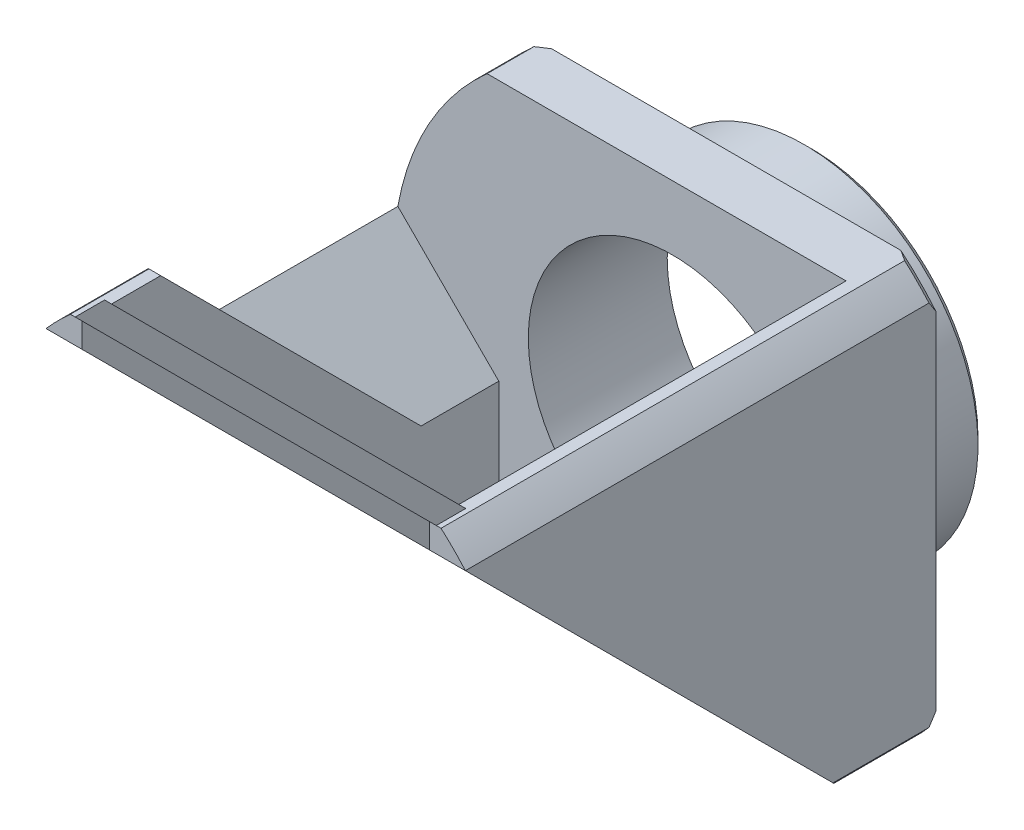
ISO-10303-21;
HEADER;
FILE_DESCRIPTION(('STEP AP214'),'2;1');
FILE_NAME('part.step','',(''),(''),'','','');
FILE_SCHEMA(('AUTOMOTIVE_DESIGN { 1 0 10303 214 1 1 1 1 }'));
ENDSEC;
DATA;
#1=APPLICATION_CONTEXT('core data for automotive mechanical design processes');
#2=APPLICATION_PROTOCOL_DEFINITION('international standard','automotive_design',2000,#1);
#3=PRODUCT_CONTEXT('',#1,'mechanical');
#4=PRODUCT('Part','Part','',(#3));
#5=PRODUCT_RELATED_PRODUCT_CATEGORY('part','',(#4));
#6=PRODUCT_DEFINITION_FORMATION('','',#4);
#7=PRODUCT_DEFINITION_CONTEXT('part definition',#1,'design');
#8=PRODUCT_DEFINITION('design','',#6,#7);
#9=PRODUCT_DEFINITION_SHAPE('','',#8);
#10=(LENGTH_UNIT() NAMED_UNIT(*) SI_UNIT(.MILLI.,.METRE.));
#11=(NAMED_UNIT(*) PLANE_ANGLE_UNIT() SI_UNIT($,.RADIAN.));
#12=(NAMED_UNIT(*) SI_UNIT($,.STERADIAN.) SOLID_ANGLE_UNIT());
#13=UNCERTAINTY_MEASURE_WITH_UNIT(LENGTH_MEASURE(1.E-05),#10,'distance_accuracy_value','');
#14=(GEOMETRIC_REPRESENTATION_CONTEXT(3) GLOBAL_UNCERTAINTY_ASSIGNED_CONTEXT((#13)) GLOBAL_UNIT_ASSIGNED_CONTEXT((#10,
#11,#12)) REPRESENTATION_CONTEXT('',''));
#15=CARTESIAN_POINT('',(0.,0.,0.));
#16=DIRECTION('',(0.,0.,1.));
#17=DIRECTION('',(1.,0.,0.));
#18=AXIS2_PLACEMENT_3D('',#15,#16,#17);
#19=CARTESIAN_POINT('',(0.,-15.24,-25.7974855953163));
#20=DIRECTION('',(0.,-1.,0.));
#21=DIRECTION('',(1.,0.,0.));
#22=AXIS2_PLACEMENT_3D('',#19,#20,#21);
#23=PLANE('',#22);
#24=DIRECTION('',(-1.,0.,0.));
#25=VECTOR('',#24,1.);
#26=CARTESIAN_POINT('',(14.8645111728715,-15.24,6.223));
#27=LINE('',#26,#25);
#28=CARTESIAN_POINT('',(27.6427308939441,-15.24,6.223));
#29=VERTEX_POINT('',#28);
#30=CARTESIAN_POINT('',(2.08629145179882,-15.24,6.223));
#31=VERTEX_POINT('',#30);
#32=EDGE_CURVE('E502',#29,#31,#27,.T.);
#33=ORIENTED_EDGE('',*,*,#32,.F.);
#34=CARTESIAN_POINT('',(27.6427308939441,-15.24,6.223));
#35=CARTESIAN_POINT('',(27.7729071237193,-15.24,6.30666414870029));
#36=CARTESIAN_POINT('',(27.9027556795337,-15.24,6.3908295644751));
#37=CARTESIAN_POINT('',(28.1617973943087,-15.24,6.56016289818711));
#38=CARTESIAN_POINT('',(28.2909905535169,-15.24,6.64533081574555));
#39=CARTESIAN_POINT('',(28.4198560390119,-15.24,6.73099999999977));
#40=B_SPLINE_CURVE_WITH_KNOTS('',3,(#34,#35,#36,#37,#38,#39),.UNSPECIFIED.,.F.,.F.,(4,2,4),(0.,
0.464219971497142,0.928439767614068),.UNSPECIFIED.);
#41=CARTESIAN_POINT('',(28.4198560390119,-15.24,6.73099999999976));
#42=VERTEX_POINT('',#41);
#43=EDGE_CURVE('E660',#29,#42,#40,.T.);
#44=ORIENTED_EDGE('',*,*,#43,.T.);
#45=DIRECTION('',(0.,0.,-1.));
#46=VECTOR('',#45,1.);
#47=CARTESIAN_POINT('',(28.4198560390119,-15.24,35.56));
#48=LINE('',#47,#46);
#49=CARTESIAN_POINT('',(28.4198560390119,-15.24,11.9560512242138));
#50=VERTEX_POINT('',#49);
#51=EDGE_CURVE('E380',#50,#42,#48,.T.);
#52=ORIENTED_EDGE('',*,*,#51,.F.);
#53=DIRECTION('',(1.,0.,0.));
#54=VECTOR('',#53,1.);
#55=CARTESIAN_POINT('',(0.,-15.24,11.9560512242138));
#56=LINE('',#55,#54);
#57=CARTESIAN_POINT('',(27.5645111728715,-15.24,11.9560512242138));
#58=VERTEX_POINT('',#57);
#59=EDGE_CURVE('E1137',#50,#58,#56,.F.);
#60=ORIENTED_EDGE('',*,*,#59,.T.);
#61=DIRECTION('',(0.,0.,1.));
#62=VECTOR('',#61,1.);
#63=CARTESIAN_POINT('',(27.5645111728715,-15.24,10.16));
#64=LINE('',#63,#62);
#65=CARTESIAN_POINT('',(27.5645111728715,-15.24,10.16));
#66=VERTEX_POINT('',#65);
#67=EDGE_CURVE('E303',#66,#58,#64,.T.);
#68=ORIENTED_EDGE('',*,*,#67,.F.);
#69=DIRECTION('',(-1.,0.,0.));
#70=VECTOR('',#69,1.);
#71=CARTESIAN_POINT('',(27.5645111728715,-15.24,10.16));
#72=LINE('',#71,#70);
#73=CARTESIAN_POINT('',(2.16451117287146,-15.24,10.16));
#74=VERTEX_POINT('',#73);
#75=EDGE_CURVE('E355',#66,#74,#72,.T.);
#76=ORIENTED_EDGE('',*,*,#75,.T.);
#77=DIRECTION('',(0.,0.,1.));
#78=VECTOR('',#77,1.);
#79=CARTESIAN_POINT('',(2.16451117287146,-15.24,10.16));
#80=LINE('',#79,#78);
#81=CARTESIAN_POINT('',(2.16451117287146,-15.24,11.9560512242138));
#82=VERTEX_POINT('',#81);
#83=EDGE_CURVE('E345',#74,#82,#80,.T.);
#84=ORIENTED_EDGE('',*,*,#83,.T.);
#85=DIRECTION('',(1.,0.,0.));
#86=VECTOR('',#85,1.);
#87=CARTESIAN_POINT('',(-5.53168882712855,-15.24,11.9560512242138));
#88=LINE('',#87,#86);
#89=CARTESIAN_POINT('',(1.30916630673102,-15.24,11.9560512242138));
#90=VERTEX_POINT('',#89);
#91=EDGE_CURVE('E492',#90,#82,#88,.T.);
#92=ORIENTED_EDGE('',*,*,#91,.F.);
#93=DIRECTION('',(0.,0.,1.));
#94=VECTOR('',#93,1.);
#95=CARTESIAN_POINT('',(1.30916630673101,-15.24,-25.7974855953163));
#96=LINE('',#95,#94);
#97=CARTESIAN_POINT('',(1.30916630673101,-15.24,6.73099999999976));
#98=VERTEX_POINT('',#97);
#99=EDGE_CURVE('E539',#90,#98,#96,.F.);
#100=ORIENTED_EDGE('',*,*,#99,.T.);
#101=CARTESIAN_POINT('',(1.30916630673102,-15.24,6.73099999999976));
#102=CARTESIAN_POINT('',(1.43803179222603,-15.24,6.64533081574554));
#103=CARTESIAN_POINT('',(1.56722495143419,-15.24,6.56016289818711));
#104=CARTESIAN_POINT('',(1.8262666662092,-15.24,6.3908295644751));
#105=CARTESIAN_POINT('',(1.95611522202365,-15.24,6.30666414870029));
#106=CARTESIAN_POINT('',(2.08629145179882,-15.24,6.223));
#107=B_SPLINE_CURVE_WITH_KNOTS('',3,(#101,#102,#103,#104,#105,#106),.UNSPECIFIED.,.F.,.F.,(4,2,
4),(0.,0.464219796116912,0.92843976761404),.UNSPECIFIED.);
#108=EDGE_CURVE('E653',#98,#31,#107,.T.);
#109=ORIENTED_EDGE('',*,*,#108,.T.);
#110=EDGE_LOOP('',(#33,#44,#52,#60,#68,#76,#84,#92,#100,#109));
#111=FACE_BOUND('',#110,.T.);
#112=ADVANCED_FACE('F56',(#111),#23,.T.);
#113=CARTESIAN_POINT('',(0.,15.24,-25.7974855953163));
#114=DIRECTION('',(0.,-1.,0.));
#115=DIRECTION('',(0.,0.,-1.));
#116=AXIS2_PLACEMENT_3D('',#113,#114,#115);
#117=PLANE('',#116);
#118=DIRECTION('',(0.,0.,-1.));
#119=VECTOR('',#118,1.);
#120=CARTESIAN_POINT('',(28.4198560390087,15.2400000000029,35.56));
#121=LINE('',#120,#119);
#122=CARTESIAN_POINT('',(28.4198560390087,15.2400000000029,6.73099999999976));
#123=VERTEX_POINT('',#122);
#124=CARTESIAN_POINT('',(28.4198560390103,15.2400000000014,40.64));
#125=VERTEX_POINT('',#124);
#126=EDGE_CURVE('E387',#123,#125,#121,.F.);
#127=ORIENTED_EDGE('',*,*,#126,.F.);
#128=CARTESIAN_POINT('',(28.4198560390087,15.2400000000029,6.73099999999976));
#129=CARTESIAN_POINT('',(28.2909905535145,15.2400000000014,6.64533081574505));
#130=CARTESIAN_POINT('',(28.1617973943071,15.2400000000005,6.56016289818637));
#131=CARTESIAN_POINT('',(27.9027556795331,15.2399999999995,6.39082956447436));
#132=CARTESIAN_POINT('',(27.7729071237191,15.2399999999995,6.30666414869979));
#133=CARTESIAN_POINT('',(27.6427308939441,15.24,6.223));
#134=B_SPLINE_CURVE_WITH_KNOTS('',3,(#128,#129,#130,#131,#132,#133),.UNSPECIFIED.,.F.,.F.,(4,2,
4),(0.,0.464219796115568,0.92843976761134),.UNSPECIFIED.);
#135=CARTESIAN_POINT('',(27.6427308939441,15.24,6.223));
#136=VERTEX_POINT('',#135);
#137=EDGE_CURVE('E81',#123,#136,#134,.T.);
#138=ORIENTED_EDGE('',*,*,#137,.T.);
#139=DIRECTION('',(-1.,0.,0.));
#140=VECTOR('',#139,1.);
#141=CARTESIAN_POINT('',(14.8645111728715,15.24,6.223));
#142=LINE('',#141,#140);
#143=CARTESIAN_POINT('',(2.08629145179882,15.24,6.223));
#144=VERTEX_POINT('',#143);
#145=EDGE_CURVE('E389',#144,#136,#142,.F.);
#146=ORIENTED_EDGE('',*,*,#145,.F.);
#147=CARTESIAN_POINT('',(2.08629145179882,15.24,6.223));
#148=CARTESIAN_POINT('',(1.95611522202365,15.24,6.30666414870029));
#149=CARTESIAN_POINT('',(1.82626666620921,15.24,6.3908295644751));
#150=CARTESIAN_POINT('',(1.56722495143419,15.24,6.56016289818711));
#151=CARTESIAN_POINT('',(1.43803179222603,15.24,6.64533081574555));
#152=CARTESIAN_POINT('',(1.30916630673102,15.24,6.73099999999976));
#153=B_SPLINE_CURVE_WITH_KNOTS('',3,(#147,#148,#149,#150,#151,#152),.UNSPECIFIED.,.F.,.F.,(4,2,
4),(0.,0.464219971497129,0.928439767614042),.UNSPECIFIED.);
#154=CARTESIAN_POINT('',(1.30916630673101,15.24,6.73099999999976));
#155=VERTEX_POINT('',#154);
#156=EDGE_CURVE('E73',#144,#155,#153,.T.);
#157=ORIENTED_EDGE('',*,*,#156,.T.);
#158=DIRECTION('',(0.,0.,-1.));
#159=VECTOR('',#158,1.);
#160=CARTESIAN_POINT('',(1.30916630673101,15.24,-25.7974855953163));
#161=LINE('',#160,#159);
#162=CARTESIAN_POINT('',(1.30916630673102,15.24,10.16));
#163=VERTEX_POINT('',#162);
#164=EDGE_CURVE('E320',#163,#155,#161,.T.);
#165=ORIENTED_EDGE('',*,*,#164,.F.);
#166=DIRECTION('',(-1.,0.,0.));
#167=VECTOR('',#166,1.);
#168=CARTESIAN_POINT('',(2.16451117287145,15.24,10.16));
#169=LINE('',#168,#167);
#170=CARTESIAN_POINT('',(27.5645111728715,15.24,10.16));
#171=VERTEX_POINT('',#170);
#172=EDGE_CURVE('E1289',#171,#163,#169,.T.);
#173=ORIENTED_EDGE('',*,*,#172,.F.);
#174=DIRECTION('',(0.,0.,-1.));
#175=VECTOR('',#174,1.);
#176=CARTESIAN_POINT('',(27.5645111728715,15.24,40.64));
#177=LINE('',#176,#175);
#178=CARTESIAN_POINT('',(27.5645111728715,15.24,38.4847385309434));
#179=VERTEX_POINT('',#178);
#180=EDGE_CURVE('E297',#179,#171,#177,.T.);
#181=ORIENTED_EDGE('',*,*,#180,.F.);
#182=DIRECTION('',(-1.,0.,0.));
#183=VECTOR('',#182,1.);
#184=CARTESIAN_POINT('',(28.0725111728715,15.24,38.4847385309434));
#185=LINE('',#184,#183);
#186=CARTESIAN_POINT('',(28.0725111728715,15.24,38.4847385309434));
#187=VERTEX_POINT('',#186);
#188=EDGE_CURVE('E262',#187,#179,#185,.T.);
#189=ORIENTED_EDGE('',*,*,#188,.F.);
#190=DIRECTION('',(0.,0.,-1.));
#191=VECTOR('',#190,1.);
#192=CARTESIAN_POINT('',(28.0725111728715,15.24,40.64));
#193=LINE('',#192,#191);
#194=CARTESIAN_POINT('',(28.0725111728715,15.24,40.64));
#195=VERTEX_POINT('',#194);
#196=EDGE_CURVE('E236',#195,#187,#193,.T.);
#197=ORIENTED_EDGE('',*,*,#196,.F.);
#198=DIRECTION('',(1.,0.,0.));
#199=VECTOR('',#198,1.);
#200=CARTESIAN_POINT('',(0.,15.24,40.64));
#201=LINE('',#200,#199);
#202=EDGE_CURVE('E326',#125,#195,#201,.F.);
#203=ORIENTED_EDGE('',*,*,#202,.F.);
#204=EDGE_LOOP('',(#127,#138,#146,#157,#165,#173,#181,#189,#197,#203));
#205=FACE_BOUND('',#204,.T.);
#206=ADVANCED_FACE('F644',(#205),#117,.F.);
#207=CARTESIAN_POINT('',(0.,0.,40.64));
#208=DIRECTION('',(0.,0.,1.));
#209=DIRECTION('',(1.,0.,0.));
#210=AXIS2_PLACEMENT_3D('',#207,#208,#209);
#211=PLANE('',#210);
#212=ORIENTED_EDGE('',*,*,#202,.T.);
#213=DIRECTION('',(-1.,0.,0.));
#214=VECTOR('',#213,1.);
#215=CARTESIAN_POINT('',(28.0725111728715,15.24,40.64));
#216=LINE('',#215,#214);
#217=CARTESIAN_POINT('',(27.5645111728715,15.24,40.64));
#218=VERTEX_POINT('',#217);
#219=EDGE_CURVE('E265',#195,#218,#216,.T.);
#220=ORIENTED_EDGE('',*,*,#219,.T.);
#221=DIRECTION('',(0.,1.,0.));
#222=VECTOR('',#221,1.);
#223=CARTESIAN_POINT('',(27.5645111728715,13.4439487757862,40.64));
#224=LINE('',#223,#222);
#225=CARTESIAN_POINT('',(27.5645111728715,13.4439487757862,40.64));
#226=VERTEX_POINT('',#225);
#227=EDGE_CURVE('E300',#226,#218,#224,.T.);
#228=ORIENTED_EDGE('',*,*,#227,.F.);
#229=DIRECTION('',(1.,0.,0.));
#230=VECTOR('',#229,1.);
#231=CARTESIAN_POINT('',(35.260711172874,13.4439487757862,40.64));
#232=LINE('',#231,#230);
#233=CARTESIAN_POINT('',(30.2028688344348,13.4439487757862,40.64));
#234=VERTEX_POINT('',#233);
#235=EDGE_CURVE('E369',#226,#234,#232,.T.);
#236=ORIENTED_EDGE('',*,*,#235,.T.);
#237=CARTESIAN_POINT('',(14.8645111728715,0.,40.64));
#238=DIRECTION('',(0.,0.,-1.));
#239=DIRECTION('',(-1.,0.,0.));
#240=AXIS2_PLACEMENT_3D('',#237,#238,#239);
#241=CIRCLE('',#240,20.3962);
#242=EDGE_CURVE('E406',#125,#234,#241,.T.);
#243=ORIENTED_EDGE('',*,*,#242,.F.);
#244=EDGE_LOOP('',(#212,#220,#228,#236,#243));
#245=FACE_BOUND('',#244,.T.);
#246=ADVANCED_FACE('F367',(#245),#211,.T.);
#247=CARTESIAN_POINT('',(35.260711172874,13.4439487757862,40.64));
#248=DIRECTION('',(0.,0.707106781186548,-0.707106781186548));
#249=DIRECTION('',(0.,0.707106781186548,0.707106781186548));
#250=AXIS2_PLACEMENT_3D('',#247,#248,#249);
#251=PLANE('',#250);
#252=DIRECTION('',(0.,0.707106781186547,0.707106781186548));
#253=VECTOR('',#252,1.);
#254=CARTESIAN_POINT('',(27.5645111728715,-15.24,11.9560512242138));
#255=LINE('',#254,#253);
#256=EDGE_CURVE('E348',#58,#226,#255,.T.);
#257=ORIENTED_EDGE('',*,*,#256,.F.);
#258=ORIENTED_EDGE('',*,*,#59,.F.);
#259=CARTESIAN_POINT('',(14.8645111728715,0.,27.1960512242138));
#260=DIRECTION('',(0.,0.707106781186548,-0.707106781186548));
#261=DIRECTION('',(0.,-0.707106781186548,-0.707106781186548));
#262=AXIS2_PLACEMENT_3D('',#259,#260,#261);
#263=ELLIPSE('',#262,28.8445826608741,20.3962);
#264=CARTESIAN_POINT('',(30.2028688344348,-13.4439487757862,13.7521024484277));
#265=VERTEX_POINT('',#264);
#266=EDGE_CURVE('E379',#265,#50,#263,.T.);
#267=ORIENTED_EDGE('',*,*,#266,.F.);
#268=DIRECTION('',(0.,0.707106781186548,0.707106781186548));
#269=VECTOR('',#268,1.);
#270=CARTESIAN_POINT('',(30.2028688344348,-13.4439487757862,13.7521024484277));
#271=LINE('',#270,#269);
#272=EDGE_CURVE('E377',#265,#234,#271,.T.);
#273=ORIENTED_EDGE('',*,*,#272,.T.);
#274=ORIENTED_EDGE('',*,*,#235,.F.);
#275=EDGE_LOOP('',(#257,#258,#267,#273,#274));
#276=FACE_BOUND('',#275,.T.);
#277=ADVANCED_FACE('F373',(#276),#251,.F.);
#278=CARTESIAN_POINT('',(-5.45548882712859,3.81,23.4626360825158));
#279=DIRECTION('',(0.707106781186551,0.707106781186544,0.));
#280=DIRECTION('',(-0.707106781186544,0.707106781186551,0.));
#281=AXIS2_PLACEMENT_3D('',#278,#279,#280);
#282=PLANE('',#281);
#283=DIRECTION('',(0.577350269189622,-0.577350269189628,-0.577350269189628));
#284=VECTOR('',#283,1.);
#285=CARTESIAN_POINT('',(-5.21662353885917,3.57113471173058,23.2237707942464));
#286=LINE('',#285,#284);
#287=CARTESIAN_POINT('',(-5.21662353885917,3.57113471173058,23.2237707942464));
#288=VERTEX_POINT('',#287);
#289=CARTESIAN_POINT('',(2.16451117287146,-3.81000000000013,15.8426360825157));
#290=VERTEX_POINT('',#289);
#291=EDGE_CURVE('E479',#288,#290,#286,.T.);
#292=ORIENTED_EDGE('',*,*,#291,.T.);
#293=DIRECTION('',(0.,0.,1.));
#294=VECTOR('',#293,1.);
#295=CARTESIAN_POINT('',(2.16451117287146,-3.81000000000014,10.16));
#296=LINE('',#295,#294);
#297=CARTESIAN_POINT('',(2.16451117287146,-3.81000000000013,10.16));
#298=VERTEX_POINT('',#297);
#299=EDGE_CURVE('E328',#298,#290,#296,.T.);
#300=ORIENTED_EDGE('',*,*,#299,.F.);
#301=DIRECTION('',(0.707106781186543,-0.707106781186552,0.));
#302=VECTOR('',#301,1.);
#303=CARTESIAN_POINT('',(-5.21662353885917,3.57113471173058,10.16));
#304=LINE('',#303,#302);
#305=CARTESIAN_POINT('',(-5.21662353885917,3.57113471173058,10.16));
#306=VERTEX_POINT('',#305);
#307=EDGE_CURVE('E1287',#306,#298,#304,.T.);
#308=ORIENTED_EDGE('',*,*,#307,.F.);
#309=DIRECTION('',(0.,0.,-1.));
#310=VECTOR('',#309,1.);
#311=CARTESIAN_POINT('',(-5.21662353885917,3.57113471173059,35.56));
#312=LINE('',#311,#310);
#313=EDGE_CURVE('E1121',#288,#306,#312,.T.);
#314=ORIENTED_EDGE('',*,*,#313,.F.);
#315=EDGE_LOOP('',(#292,#300,#308,#314));
#316=FACE_BOUND('',#315,.T.);
#317=ADVANCED_FACE('F591',(#316),#282,.T.);
#318=CARTESIAN_POINT('',(14.8645111728715,0.,35.56));
#319=DIRECTION('',(0.,0.,-1.));
#320=DIRECTION('',(-1.,0.,0.));
#321=AXIS2_PLACEMENT_3D('',#318,#319,#320);
#322=CYLINDRICAL_SURFACE('',#321,20.3962);
#323=ORIENTED_EDGE('',*,*,#164,.T.);
#324=CARTESIAN_POINT('',(14.8645111728715,0.,6.73099999999976));
#325=DIRECTION('',(0.,0.,-1.));
#326=DIRECTION('',(-1.,0.,0.));
#327=AXIS2_PLACEMENT_3D('',#324,#325,#326);
#328=CIRCLE('',#327,20.3962);
#329=EDGE_CURVE('E13',#155,#98,#328,.F.);
#330=ORIENTED_EDGE('',*,*,#329,.T.);
#331=ORIENTED_EDGE('',*,*,#99,.F.);
#332=CARTESIAN_POINT('',(14.8645111728715,0.,27.1960512242138));
#333=DIRECTION('',(0.,-0.707106781186548,0.707106781186548));
#334=DIRECTION('',(0.,-0.707106781186548,-0.707106781186548));
#335=AXIS2_PLACEMENT_3D('',#332,#333,#334);
#336=ELLIPSE('',#335,28.8445826608741,20.3962);
#337=CARTESIAN_POINT('',(-0.47384648869184,13.4439487757862,40.64));
#338=VERTEX_POINT('',#337);
#339=EDGE_CURVE('E558',#90,#338,#336,.F.);
#340=ORIENTED_EDGE('',*,*,#339,.T.);
#341=CARTESIAN_POINT('',(14.8645111728715,0.,40.64));
#342=DIRECTION('',(0.,0.,-1.));
#343=DIRECTION('',(-1.,0.,0.));
#344=AXIS2_PLACEMENT_3D('',#341,#342,#343);
#345=CIRCLE('',#344,20.3962);
#346=CARTESIAN_POINT('',(1.30916630673102,15.24,40.64));
#347=VERTEX_POINT('',#346);
#348=EDGE_CURVE('E551',#338,#347,#345,.T.);
#349=ORIENTED_EDGE('',*,*,#348,.T.);
#350=DIRECTION('',(0.,0.,-1.));
#351=VECTOR('',#350,1.);
#352=CARTESIAN_POINT('',(1.30916630673102,15.24,35.56));
#353=LINE('',#352,#351);
#354=CARTESIAN_POINT('',(1.30916630673102,15.24,34.8926360825158));
#355=VERTEX_POINT('',#354);
#356=EDGE_CURVE('E557',#347,#355,#353,.T.);
#357=ORIENTED_EDGE('',*,*,#356,.T.);
#358=CARTESIAN_POINT('',(14.8645111728715,0.,19.6526360825158));
#359=DIRECTION('',(0.,-0.707106781186548,0.707106781186547));
#360=DIRECTION('',(0.,-0.707106781186547,-0.707106781186548));
#361=AXIS2_PLACEMENT_3D('',#358,#359,#360);
#362=ELLIPSE('',#361,28.8445826608741,20.3962);
#363=EDGE_CURVE('E559',#355,#288,#362,.T.);
#364=ORIENTED_EDGE('',*,*,#363,.T.);
#365=ORIENTED_EDGE('',*,*,#313,.T.);
#366=CARTESIAN_POINT('',(14.8645111728715,0.,10.16));
#367=DIRECTION('',(0.,0.,1.));
#368=DIRECTION('',(1.,0.,0.));
#369=AXIS2_PLACEMENT_3D('',#366,#367,#368);
#370=CIRCLE('',#369,20.3962);
#371=EDGE_CURVE('E1284',#163,#306,#370,.T.);
#372=ORIENTED_EDGE('',*,*,#371,.F.);
#373=EDGE_LOOP('',(#323,#330,#331,#340,#349,#357,#364,#365,#372));
#374=FACE_BOUND('',#373,.T.);
#375=ADVANCED_FACE('F642',(#374),#322,.T.);
#376=DIRECTION('',(0.,0.,1.));
#377=VECTOR('',#376,1.);
#378=CARTESIAN_POINT('',(1.65651117287145,15.24,38.4847385309434));
#379=LINE('',#378,#377);
#380=CARTESIAN_POINT('',(1.65651117287145,15.24,38.4847385309434));
#381=VERTEX_POINT('',#380);
#382=CARTESIAN_POINT('',(1.65651117287145,15.24,40.64));
#383=VERTEX_POINT('',#382);
#384=EDGE_CURVE('E270',#381,#383,#379,.T.);
#385=ORIENTED_EDGE('',*,*,#384,.F.);
#386=DIRECTION('',(1.,0.,0.));
#387=VECTOR('',#386,1.);
#388=CARTESIAN_POINT('',(1.65651117287145,15.24,38.4847385309434));
#389=LINE('',#388,#387);
#390=CARTESIAN_POINT('',(2.16451117287146,15.24,38.4847385309434));
#391=VERTEX_POINT('',#390);
#392=EDGE_CURVE('E290',#381,#391,#389,.T.);
#393=ORIENTED_EDGE('',*,*,#392,.T.);
#394=DIRECTION('',(0.,0.,-1.));
#395=VECTOR('',#394,1.);
#396=CARTESIAN_POINT('',(2.16451117287146,15.24,40.64));
#397=LINE('',#396,#395);
#398=CARTESIAN_POINT('',(2.16451117287146,15.24,34.8926360825158));
#399=VERTEX_POINT('',#398);
#400=EDGE_CURVE('E309',#391,#399,#397,.T.);
#401=ORIENTED_EDGE('',*,*,#400,.T.);
#402=DIRECTION('',(1.,0.,0.));
#403=VECTOR('',#402,1.);
#404=CARTESIAN_POINT('',(-5.53268882712855,15.24,34.8926360825158));
#405=LINE('',#404,#403);
#406=EDGE_CURVE('E481',#399,#355,#405,.F.);
#407=ORIENTED_EDGE('',*,*,#406,.T.);
#408=ORIENTED_EDGE('',*,*,#356,.F.);
#409=EDGE_CURVE('E315',#383,#347,#201,.F.);
#410=ORIENTED_EDGE('',*,*,#409,.F.);
#411=EDGE_LOOP('',(#385,#393,#401,#407,#408,#410));
#412=FACE_BOUND('',#411,.T.);
#413=ADVANCED_FACE('F637',(#412),#117,.F.);
#414=DIRECTION('',(0.,1.,0.));
#415=VECTOR('',#414,1.);
#416=CARTESIAN_POINT('',(2.16451117287146,13.4439487757862,40.64));
#417=LINE('',#416,#415);
#418=CARTESIAN_POINT('',(2.16451117287146,13.4439487757862,40.64));
#419=VERTEX_POINT('',#418);
#420=CARTESIAN_POINT('',(2.16451117287146,15.24,40.64));
#421=VERTEX_POINT('',#420);
#422=EDGE_CURVE('E312',#419,#421,#417,.T.);
#423=ORIENTED_EDGE('',*,*,#422,.T.);
#424=EDGE_CURVE('E319',#421,#383,#201,.F.);
#425=ORIENTED_EDGE('',*,*,#424,.T.);
#426=ORIENTED_EDGE('',*,*,#409,.T.);
#427=ORIENTED_EDGE('',*,*,#348,.F.);
#428=DIRECTION('',(1.,0.,0.));
#429=VECTOR('',#428,1.);
#430=CARTESIAN_POINT('',(0.,13.4439487757862,40.64));
#431=LINE('',#430,#429);
#432=EDGE_CURVE('E486',#338,#419,#431,.T.);
#433=ORIENTED_EDGE('',*,*,#432,.T.);
#434=EDGE_LOOP('',(#423,#425,#426,#427,#433));
#435=FACE_BOUND('',#434,.T.);
#436=ADVANCED_FACE('F641',(#435),#211,.T.);
#437=CARTESIAN_POINT('',(14.8645111728715,0.,6.223));
#438=DIRECTION('',(0.,0.,-1.));
#439=DIRECTION('',(-1.,0.,0.));
#440=AXIS2_PLACEMENT_3D('',#437,#438,#439);
#441=PLANE('',#440);
#442=CARTESIAN_POINT('',(14.8645111728715,0.,6.223));
#443=DIRECTION('',(0.,0.,-1.));
#444=DIRECTION('',(-1.,0.,0.));
#445=AXIS2_PLACEMENT_3D('',#442,#443,#444);
#446=CIRCLE('',#445,12.7);
#447=CARTESIAN_POINT('',(2.16451117287146,0.,6.223));
#448=VERTEX_POINT('',#447);
#449=EDGE_CURVE('E254',#448,#448,#446,.T.);
#450=ORIENTED_EDGE('',*,*,#449,.F.);
#451=EDGE_LOOP('',(#450));
#452=FACE_BOUND('',#451,.T.);
#453=DIRECTION('',(0.,1.,0.));
#454=VECTOR('',#453,1.);
#455=CARTESIAN_POINT('',(30.2028688344348,13.4439487757862,6.223));
#456=LINE('',#455,#454);
#457=CARTESIAN_POINT('',(30.2028688344348,12.6599874994398,6.223));
#458=VERTEX_POINT('',#457);
#459=CARTESIAN_POINT('',(30.2028688344348,-12.6599874994398,6.223));
#460=VERTEX_POINT('',#459);
#461=EDGE_CURVE('E410',#458,#460,#456,.F.);
#462=ORIENTED_EDGE('',*,*,#461,.T.);
#463=CARTESIAN_POINT('',(14.8645111728715,0.,6.223));
#464=DIRECTION('',(0.,0.,-1.));
#465=DIRECTION('',(-1.,0.,0.));
#466=AXIS2_PLACEMENT_3D('',#463,#464,#465);
#467=CIRCLE('',#466,19.8882000000002);
#468=EDGE_CURVE('E1255',#460,#29,#467,.T.);
#469=ORIENTED_EDGE('',*,*,#468,.T.);
#470=ORIENTED_EDGE('',*,*,#32,.T.);
#471=CARTESIAN_POINT('',(14.8645111728715,0.,6.223));
#472=DIRECTION('',(0.,0.,-1.));
#473=DIRECTION('',(-1.,0.,0.));
#474=AXIS2_PLACEMENT_3D('',#471,#472,#473);
#475=CIRCLE('',#474,19.8882000000002);
#476=EDGE_CURVE('E1256',#31,#144,#475,.T.);
#477=ORIENTED_EDGE('',*,*,#476,.T.);
#478=ORIENTED_EDGE('',*,*,#145,.T.);
#479=CARTESIAN_POINT('',(14.8645111728715,0.,6.223));
#480=DIRECTION('',(0.,0.,-1.));
#481=DIRECTION('',(-1.,0.,0.));
#482=AXIS2_PLACEMENT_3D('',#479,#480,#481);
#483=CIRCLE('',#482,19.8882000000002);
#484=EDGE_CURVE('E1253',#136,#458,#483,.T.);
#485=ORIENTED_EDGE('',*,*,#484,.T.);
#486=EDGE_LOOP('',(#462,#469,#470,#477,#478,#485));
#487=FACE_BOUND('',#486,.T.);
#488=ADVANCED_FACE('F749',(#452,#487),#441,.T.);
#489=CARTESIAN_POINT('',(14.8645111728715,0.,35.56));
#490=DIRECTION('',(0.,0.,-1.));
#491=DIRECTION('',(-1.,0.,0.));
#492=AXIS2_PLACEMENT_3D('',#489,#490,#491);
#493=CYLINDRICAL_SURFACE('',#492,20.3962);
#494=ORIENTED_EDGE('',*,*,#51,.T.);
#495=CARTESIAN_POINT('',(14.8645111728715,0.,6.73099999999976));
#496=DIRECTION('',(0.,0.,-1.));
#497=DIRECTION('',(-1.,0.,0.));
#498=AXIS2_PLACEMENT_3D('',#495,#496,#497);
#499=CIRCLE('',#498,20.3962);
#500=CARTESIAN_POINT('',(30.2028688344348,-13.4439487757862,6.73099999999976));
#501=VERTEX_POINT('',#500);
#502=EDGE_CURVE('E321',#42,#501,#499,.F.);
#503=ORIENTED_EDGE('',*,*,#502,.T.);
#504=DIRECTION('',(0.,0.,1.));
#505=VECTOR('',#504,1.);
#506=CARTESIAN_POINT('',(30.2028688344348,-13.4439487757862,-0.001000000000001));
#507=LINE('',#506,#505);
#508=EDGE_CURVE('E568',#501,#265,#507,.T.);
#509=ORIENTED_EDGE('',*,*,#508,.T.);
#510=ORIENTED_EDGE('',*,*,#266,.T.);
#511=EDGE_LOOP('',(#494,#503,#509,#510));
#512=FACE_BOUND('',#511,.T.);
#513=ADVANCED_FACE('F753',(#512),#493,.T.);
#514=ORIENTED_EDGE('',*,*,#91,.T.);
#515=DIRECTION('',(0.,0.707106781186547,0.707106781186548));
#516=VECTOR('',#515,1.);
#517=CARTESIAN_POINT('',(2.16451117287146,-15.24,11.9560512242138));
#518=LINE('',#517,#516);
#519=EDGE_CURVE('E293',#82,#419,#518,.T.);
#520=ORIENTED_EDGE('',*,*,#519,.T.);
#521=ORIENTED_EDGE('',*,*,#432,.F.);
#522=ORIENTED_EDGE('',*,*,#339,.F.);
#523=EDGE_LOOP('',(#514,#520,#521,#522));
#524=FACE_BOUND('',#523,.T.);
#525=ADVANCED_FACE('F761',(#524),#251,.F.);
#526=CARTESIAN_POINT('',(14.8645111728715,0.,35.56));
#527=DIRECTION('',(0.,0.,-1.));
#528=DIRECTION('',(-1.,0.,0.));
#529=AXIS2_PLACEMENT_3D('',#526,#527,#528);
#530=CYLINDRICAL_SURFACE('',#529,20.3962);
#531=DIRECTION('',(0.,0.,1.));
#532=VECTOR('',#531,1.);
#533=CARTESIAN_POINT('',(30.2028688344348,13.4439487757862,-0.001000000000001));
#534=LINE('',#533,#532);
#535=CARTESIAN_POINT('',(30.2028688344348,13.4439487757862,6.73099999999976));
#536=VERTEX_POINT('',#535);
#537=EDGE_CURVE('E565',#234,#536,#534,.F.);
#538=ORIENTED_EDGE('',*,*,#537,.T.);
#539=CARTESIAN_POINT('',(14.8645111728715,0.,6.73099999999976));
#540=DIRECTION('',(0.,0.,-1.));
#541=DIRECTION('',(-1.,0.,0.));
#542=AXIS2_PLACEMENT_3D('',#539,#540,#541);
#543=CIRCLE('',#542,20.3962);
#544=EDGE_CURVE('E665',#536,#123,#543,.F.);
#545=ORIENTED_EDGE('',*,*,#544,.T.);
#546=ORIENTED_EDGE('',*,*,#126,.T.);
#547=ORIENTED_EDGE('',*,*,#242,.T.);
#548=EDGE_LOOP('',(#538,#545,#546,#547));
#549=FACE_BOUND('',#548,.T.);
#550=ADVANCED_FACE('F589',(#549),#530,.T.);
#551=CARTESIAN_POINT('',(30.2028688344348,13.4439487757862,-0.001000000000001));
#552=DIRECTION('',(-1.,0.,0.));
#553=DIRECTION('',(0.,0.,1.));
#554=AXIS2_PLACEMENT_3D('',#551,#552,#553);
#555=PLANE('',#554);
#556=ORIENTED_EDGE('',*,*,#508,.F.);
#557=CARTESIAN_POINT('',(30.2028688344348,-13.4439487757862,6.73099999999976));
#558=CARTESIAN_POINT('',(30.2028688344348,-13.3139617670491,6.64529448123285));
#559=CARTESIAN_POINT('',(30.2028688344348,-13.1836381694069,6.5601083968503));
#560=CARTESIAN_POINT('',(30.2028688344348,-12.9223177442265,6.39077506310292));
#561=CARTESIAN_POINT('',(30.2028688344348,-12.7913209164199,6.30662781415221));
#562=CARTESIAN_POINT('',(30.2028688344348,-12.6599874994398,6.223));
#563=B_SPLINE_CURVE_WITH_KNOTS('',3,(#557,#558,#559,#560,#561,#562),.UNSPECIFIED.,.F.,.F.,(4,2,
4),(0.,0.467084769258856,0.934169724713637),.UNSPECIFIED.);
#564=EDGE_CURVE('E603',#501,#460,#563,.T.);
#565=ORIENTED_EDGE('',*,*,#564,.T.);
#566=ORIENTED_EDGE('',*,*,#461,.F.);
#567=CARTESIAN_POINT('',(30.2028688344348,12.6599874994398,6.223));
#568=CARTESIAN_POINT('',(30.2028688344348,12.7913209164199,6.30662781415222));
#569=CARTESIAN_POINT('',(30.2028688344348,12.9223177442265,6.39077506310292));
#570=CARTESIAN_POINT('',(30.2028688344348,13.1836381694069,6.5601083968503));
#571=CARTESIAN_POINT('',(30.2028688344348,13.3139617670491,6.64529448123285));
#572=CARTESIAN_POINT('',(30.2028688344348,13.4439487757862,6.73099999999976));
#573=B_SPLINE_CURVE_WITH_KNOTS('',3,(#567,#568,#569,#570,#571,#572),.UNSPECIFIED.,.F.,.F.,(4,2,
4),(0.,0.467084955454769,0.934169724713614),.UNSPECIFIED.);
#574=EDGE_CURVE('E597',#458,#536,#573,.T.);
#575=ORIENTED_EDGE('',*,*,#574,.T.);
#576=ORIENTED_EDGE('',*,*,#537,.F.);
#577=ORIENTED_EDGE('',*,*,#272,.F.);
#578=EDGE_LOOP('',(#556,#565,#566,#575,#576,#577));
#579=FACE_BOUND('',#578,.T.);
#580=ADVANCED_FACE('F583',(#579),#555,.F.);
#581=CARTESIAN_POINT('',(-5.53268882712855,15.24,34.8926360825158));
#582=DIRECTION('',(0.,-0.707106781186548,0.707106781186547));
#583=DIRECTION('',(0.,-0.707106781186547,-0.707106781186548));
#584=AXIS2_PLACEMENT_3D('',#581,#582,#583);
#585=PLANE('',#584);
#586=DIRECTION('',(0.,0.707106781186547,0.707106781186548));
#587=VECTOR('',#586,1.);
#588=CARTESIAN_POINT('',(2.16451117287146,-3.81000000000013,15.8426360825157));
#589=LINE('',#588,#587);
#590=EDGE_CURVE('E564',#290,#399,#589,.T.);
#591=ORIENTED_EDGE('',*,*,#590,.F.);
#592=ORIENTED_EDGE('',*,*,#291,.F.);
#593=ORIENTED_EDGE('',*,*,#363,.F.);
#594=ORIENTED_EDGE('',*,*,#406,.F.);
#595=EDGE_LOOP('',(#591,#592,#593,#594));
#596=FACE_BOUND('',#595,.T.);
#597=ADVANCED_FACE('F588',(#596),#585,.F.);
#598=CARTESIAN_POINT('',(14.8645111728715,0.,10.16));
#599=DIRECTION('',(0.,0.,1.));
#600=DIRECTION('',(1.,0.,0.));
#601=AXIS2_PLACEMENT_3D('',#598,#599,#600);
#602=PLANE('',#601);
#603=CARTESIAN_POINT('',(14.8645111728715,0.,10.16));
#604=DIRECTION('',(0.,0.,1.));
#605=DIRECTION('',(1.,0.,0.));
#606=AXIS2_PLACEMENT_3D('',#603,#604,#605);
#607=CIRCLE('',#606,10.541);
#608=CARTESIAN_POINT('',(25.4055111728714,0.,10.16));
#609=VERTEX_POINT('',#608);
#610=EDGE_CURVE('E260',#609,#609,#607,.T.);
#611=ORIENTED_EDGE('',*,*,#610,.F.);
#612=EDGE_LOOP('',(#611));
#613=FACE_BOUND('',#612,.T.);
#614=ORIENTED_EDGE('',*,*,#307,.T.);
#615=DIRECTION('',(0.,-1.,0.));
#616=VECTOR('',#615,1.);
#617=CARTESIAN_POINT('',(2.16451117287146,15.24,10.16));
#618=LINE('',#617,#616);
#619=EDGE_CURVE('E306',#298,#74,#618,.T.);
#620=ORIENTED_EDGE('',*,*,#619,.T.);
#621=ORIENTED_EDGE('',*,*,#75,.F.);
#622=DIRECTION('',(0.,-1.,0.));
#623=VECTOR('',#622,1.);
#624=CARTESIAN_POINT('',(27.5645111728715,15.24,10.16));
#625=LINE('',#624,#623);
#626=EDGE_CURVE('E299',#171,#66,#625,.T.);
#627=ORIENTED_EDGE('',*,*,#626,.F.);
#628=ORIENTED_EDGE('',*,*,#172,.T.);
#629=ORIENTED_EDGE('',*,*,#371,.T.);
#630=EDGE_LOOP('',(#614,#620,#621,#627,#628,#629));
#631=FACE_BOUND('',#630,.T.);
#632=ADVANCED_FACE('F931',(#613,#631),#602,.T.);
#633=CARTESIAN_POINT('',(27.5645111728715,0.,0.));
#634=DIRECTION('',(-1.,0.,0.));
#635=DIRECTION('',(0.,0.,1.));
#636=AXIS2_PLACEMENT_3D('',#633,#634,#635);
#637=PLANE('',#636);
#638=DIRECTION('',(0.,-0.707106781186548,-0.707106781186547));
#639=VECTOR('',#638,1.);
#640=CARTESIAN_POINT('',(27.5645111728715,15.24,38.4847385309434));
#641=LINE('',#640,#639);
#642=CARTESIAN_POINT('',(27.5645111728715,-12.7783990977358,10.4663394332077));
#643=VERTEX_POINT('',#642);
#644=EDGE_CURVE('E231',#179,#643,#641,.T.);
#645=ORIENTED_EDGE('',*,*,#644,.F.);
#646=ORIENTED_EDGE('',*,*,#180,.T.);
#647=ORIENTED_EDGE('',*,*,#626,.T.);
#648=ORIENTED_EDGE('',*,*,#67,.T.);
#649=ORIENTED_EDGE('',*,*,#256,.T.);
#650=ORIENTED_EDGE('',*,*,#227,.T.);
#651=DIRECTION('',(0.,0.707106781186549,0.707106781186546));
#652=VECTOR('',#651,1.);
#653=CARTESIAN_POINT('',(27.5645111728715,-13.8560298322641,11.543970167736));
#654=LINE('',#653,#652);
#655=CARTESIAN_POINT('',(27.5645111728715,-13.8560298322641,11.543970167736));
#656=VERTEX_POINT('',#655);
#657=EDGE_CURVE('E249',#656,#218,#654,.T.);
#658=ORIENTED_EDGE('',*,*,#657,.F.);
#659=DIRECTION('',(0.,-0.707106781186548,0.707106781186548));
#660=VECTOR('',#659,1.);
#661=CARTESIAN_POINT('',(27.5645111728715,-12.7783990977358,10.4663394332077));
#662=LINE('',#661,#660);
#663=EDGE_CURVE('E251',#643,#656,#662,.T.);
#664=ORIENTED_EDGE('',*,*,#663,.F.);
#665=EDGE_LOOP('',(#645,#646,#647,#648,#649,#650,#658,#664));
#666=FACE_BOUND('',#665,.T.);
#667=ADVANCED_FACE('F361',(#666),#637,.T.);
#668=CARTESIAN_POINT('',(2.16451117287146,0.,0.));
#669=DIRECTION('',(-1.,0.,0.));
#670=DIRECTION('',(0.,0.,1.));
#671=AXIS2_PLACEMENT_3D('',#668,#669,#670);
#672=PLANE('',#671);
#673=ORIENTED_EDGE('',*,*,#400,.F.);
#674=DIRECTION('',(0.,0.707106781186548,0.707106781186547));
#675=VECTOR('',#674,1.);
#676=CARTESIAN_POINT('',(2.16451117287146,-12.7783990977358,10.4663394332077));
#677=LINE('',#676,#675);
#678=CARTESIAN_POINT('',(2.16451117287146,-12.7783990977358,10.4663394332077));
#679=VERTEX_POINT('',#678);
#680=EDGE_CURVE('E274',#679,#391,#677,.T.);
#681=ORIENTED_EDGE('',*,*,#680,.F.);
#682=DIRECTION('',(0.,0.707106781186547,-0.707106781186548));
#683=VECTOR('',#682,1.);
#684=CARTESIAN_POINT('',(2.16451117287146,-13.8560298322641,11.543970167736));
#685=LINE('',#684,#683);
#686=CARTESIAN_POINT('',(2.16451117287146,-13.8560298322641,11.543970167736));
#687=VERTEX_POINT('',#686);
#688=EDGE_CURVE('E286',#687,#679,#685,.T.);
#689=ORIENTED_EDGE('',*,*,#688,.F.);
#690=DIRECTION('',(0.,-0.707106781186549,-0.707106781186546));
#691=VECTOR('',#690,1.);
#692=CARTESIAN_POINT('',(2.16451117287146,15.24,40.64));
#693=LINE('',#692,#691);
#694=EDGE_CURVE('E264',#421,#687,#693,.T.);
#695=ORIENTED_EDGE('',*,*,#694,.F.);
#696=ORIENTED_EDGE('',*,*,#422,.F.);
#697=ORIENTED_EDGE('',*,*,#519,.F.);
#698=ORIENTED_EDGE('',*,*,#83,.F.);
#699=ORIENTED_EDGE('',*,*,#619,.F.);
#700=ORIENTED_EDGE('',*,*,#299,.T.);
#701=ORIENTED_EDGE('',*,*,#590,.T.);
#702=EDGE_LOOP('',(#673,#681,#689,#695,#696,#697,#698,#699,#700,#701));
#703=FACE_BOUND('',#702,.T.);
#704=ADVANCED_FACE('F912',(#703),#672,.F.);
#705=CARTESIAN_POINT('',(1.65651117287145,-12.7783990977358,10.4663394332077));
#706=DIRECTION('',(0.,0.707106781186547,-0.707106781186548));
#707=DIRECTION('',(0.,0.707106781186548,0.707106781186547));
#708=AXIS2_PLACEMENT_3D('',#705,#706,#707);
#709=PLANE('',#708);
#710=ORIENTED_EDGE('',*,*,#680,.T.);
#711=ORIENTED_EDGE('',*,*,#392,.F.);
#712=DIRECTION('',(0.,0.707106781186548,0.707106781186547));
#713=VECTOR('',#712,1.);
#714=CARTESIAN_POINT('',(1.65651117287145,-12.7783990977358,10.4663394332077));
#715=LINE('',#714,#713);
#716=CARTESIAN_POINT('',(1.65651117287145,-12.7783990977358,10.4663394332077));
#717=VERTEX_POINT('',#716);
#718=EDGE_CURVE('E280',#717,#381,#715,.T.);
#719=ORIENTED_EDGE('',*,*,#718,.F.);
#720=DIRECTION('',(1.,0.,0.));
#721=VECTOR('',#720,1.);
#722=CARTESIAN_POINT('',(1.65651117287145,-12.7783990977358,10.4663394332077));
#723=LINE('',#722,#721);
#724=EDGE_CURVE('E294',#717,#679,#723,.T.);
#725=ORIENTED_EDGE('',*,*,#724,.T.);
#726=EDGE_LOOP('',(#710,#711,#719,#725));
#727=FACE_BOUND('',#726,.T.);
#728=ADVANCED_FACE('F902',(#727),#709,.F.);
#729=CARTESIAN_POINT('',(1.65651117287145,-13.8560298322641,11.543970167736));
#730=DIRECTION('',(0.,-0.707106781186548,-0.707106781186547));
#731=DIRECTION('',(0.,0.707106781186547,-0.707106781186548));
#732=AXIS2_PLACEMENT_3D('',#729,#730,#731);
#733=PLANE('',#732);
#734=ORIENTED_EDGE('',*,*,#688,.T.);
#735=ORIENTED_EDGE('',*,*,#724,.F.);
#736=DIRECTION('',(0.,0.707106781186547,-0.707106781186548));
#737=VECTOR('',#736,1.);
#738=CARTESIAN_POINT('',(1.65651117287145,-13.8560298322641,11.543970167736));
#739=LINE('',#738,#737);
#740=CARTESIAN_POINT('',(1.65651117287145,-13.8560298322641,11.543970167736));
#741=VERTEX_POINT('',#740);
#742=EDGE_CURVE('E277',#741,#717,#739,.T.);
#743=ORIENTED_EDGE('',*,*,#742,.F.);
#744=DIRECTION('',(1.,0.,0.));
#745=VECTOR('',#744,1.);
#746=CARTESIAN_POINT('',(1.65651117287145,-13.8560298322641,11.543970167736));
#747=LINE('',#746,#745);
#748=EDGE_CURVE('E283',#741,#687,#747,.T.);
#749=ORIENTED_EDGE('',*,*,#748,.T.);
#750=EDGE_LOOP('',(#734,#735,#743,#749));
#751=FACE_BOUND('',#750,.T.);
#752=ADVANCED_FACE('F892',(#751),#733,.F.);
#753=CARTESIAN_POINT('',(1.65651117287145,15.24,40.64));
#754=DIRECTION('',(0.,-0.707106781186546,0.707106781186549));
#755=DIRECTION('',(0.,-0.707106781186549,-0.707106781186546));
#756=AXIS2_PLACEMENT_3D('',#753,#754,#755);
#757=PLANE('',#756);
#758=ORIENTED_EDGE('',*,*,#694,.T.);
#759=ORIENTED_EDGE('',*,*,#748,.F.);
#760=DIRECTION('',(0.,-0.707106781186549,-0.707106781186546));
#761=VECTOR('',#760,1.);
#762=CARTESIAN_POINT('',(1.65651117287145,15.24,40.64));
#763=LINE('',#762,#761);
#764=EDGE_CURVE('E273',#383,#741,#763,.T.);
#765=ORIENTED_EDGE('',*,*,#764,.F.);
#766=ORIENTED_EDGE('',*,*,#424,.F.);
#767=EDGE_LOOP('',(#758,#759,#765,#766));
#768=FACE_BOUND('',#767,.T.);
#769=ADVANCED_FACE('F882',(#768),#757,.F.);
#770=CARTESIAN_POINT('',(1.65651117287145,0.,0.));
#771=DIRECTION('',(1.,0.,0.));
#772=DIRECTION('',(0.,1.,0.));
#773=AXIS2_PLACEMENT_3D('',#770,#771,#772);
#774=PLANE('',#773);
#775=ORIENTED_EDGE('',*,*,#384,.T.);
#776=ORIENTED_EDGE('',*,*,#764,.T.);
#777=ORIENTED_EDGE('',*,*,#742,.T.);
#778=ORIENTED_EDGE('',*,*,#718,.T.);
#779=EDGE_LOOP('',(#775,#776,#777,#778));
#780=FACE_BOUND('',#779,.T.);
#781=ADVANCED_FACE('F873',(#780),#774,.T.);
#782=CARTESIAN_POINT('',(28.0725111728715,15.24,38.4847385309434));
#783=DIRECTION('',(0.,0.707106781186547,-0.707106781186548));
#784=DIRECTION('',(0.,0.707106781186548,0.707106781186547));
#785=AXIS2_PLACEMENT_3D('',#782,#783,#784);
#786=PLANE('',#785);
#787=ORIENTED_EDGE('',*,*,#644,.T.);
#788=DIRECTION('',(-1.,0.,0.));
#789=VECTOR('',#788,1.);
#790=CARTESIAN_POINT('',(28.0725111728715,-12.7783990977358,10.4663394332077));
#791=LINE('',#790,#789);
#792=CARTESIAN_POINT('',(28.0725111728715,-12.7783990977358,10.4663394332077));
#793=VERTEX_POINT('',#792);
#794=EDGE_CURVE('E224',#793,#643,#791,.T.);
#795=ORIENTED_EDGE('',*,*,#794,.F.);
#796=DIRECTION('',(0.,-0.707106781186548,-0.707106781186547));
#797=VECTOR('',#796,1.);
#798=CARTESIAN_POINT('',(28.0725111728715,15.24,38.4847385309434));
#799=LINE('',#798,#797);
#800=EDGE_CURVE('E228',#187,#793,#799,.T.);
#801=ORIENTED_EDGE('',*,*,#800,.F.);
#802=ORIENTED_EDGE('',*,*,#188,.T.);
#803=EDGE_LOOP('',(#787,#795,#801,#802));
#804=FACE_BOUND('',#803,.T.);
#805=ADVANCED_FACE('F226',(#804),#786,.F.);
#806=CARTESIAN_POINT('',(28.0725111728715,-13.8560298322641,11.543970167736));
#807=DIRECTION('',(0.,-0.707106781186546,0.707106781186549));
#808=DIRECTION('',(0.,-0.707106781186549,-0.707106781186546));
#809=AXIS2_PLACEMENT_3D('',#806,#807,#808);
#810=PLANE('',#809);
#811=ORIENTED_EDGE('',*,*,#657,.T.);
#812=ORIENTED_EDGE('',*,*,#219,.F.);
#813=DIRECTION('',(0.,0.707106781186549,0.707106781186546));
#814=VECTOR('',#813,1.);
#815=CARTESIAN_POINT('',(28.0725111728715,-13.8560298322641,11.543970167736));
#816=LINE('',#815,#814);
#817=CARTESIAN_POINT('',(28.0725111728715,-13.8560298322641,11.543970167736));
#818=VERTEX_POINT('',#817);
#819=EDGE_CURVE('E244',#818,#195,#816,.T.);
#820=ORIENTED_EDGE('',*,*,#819,.F.);
#821=DIRECTION('',(-1.,0.,0.));
#822=VECTOR('',#821,1.);
#823=CARTESIAN_POINT('',(28.0725111728715,-13.8560298322641,11.543970167736));
#824=LINE('',#823,#822);
#825=EDGE_CURVE('E235',#818,#656,#824,.T.);
#826=ORIENTED_EDGE('',*,*,#825,.T.);
#827=EDGE_LOOP('',(#811,#812,#820,#826));
#828=FACE_BOUND('',#827,.T.);
#829=ADVANCED_FACE('F855',(#828),#810,.F.);
#830=CARTESIAN_POINT('',(28.0725111728715,-12.7783990977358,10.4663394332077));
#831=DIRECTION('',(0.,-0.707106781186548,-0.707106781186548));
#832=DIRECTION('',(0.,0.707106781186548,-0.707106781186548));
#833=AXIS2_PLACEMENT_3D('',#830,#831,#832);
#834=PLANE('',#833);
#835=ORIENTED_EDGE('',*,*,#663,.T.);
#836=ORIENTED_EDGE('',*,*,#825,.F.);
#837=DIRECTION('',(0.,-0.707106781186548,0.707106781186548));
#838=VECTOR('',#837,1.);
#839=CARTESIAN_POINT('',(28.0725111728715,-12.7783990977358,10.4663394332077));
#840=LINE('',#839,#838);
#841=EDGE_CURVE('E239',#793,#818,#840,.T.);
#842=ORIENTED_EDGE('',*,*,#841,.F.);
#843=ORIENTED_EDGE('',*,*,#794,.T.);
#844=EDGE_LOOP('',(#835,#836,#842,#843));
#845=FACE_BOUND('',#844,.T.);
#846=ADVANCED_FACE('F240',(#845),#834,.F.);
#847=CARTESIAN_POINT('',(28.0725111728715,0.,0.));
#848=DIRECTION('',(-1.,0.,0.));
#849=DIRECTION('',(0.,0.,1.));
#850=AXIS2_PLACEMENT_3D('',#847,#848,#849);
#851=PLANE('',#850);
#852=ORIENTED_EDGE('',*,*,#800,.T.);
#853=ORIENTED_EDGE('',*,*,#841,.T.);
#854=ORIENTED_EDGE('',*,*,#819,.T.);
#855=ORIENTED_EDGE('',*,*,#196,.T.);
#856=EDGE_LOOP('',(#852,#853,#854,#855));
#857=FACE_BOUND('',#856,.T.);
#858=ADVANCED_FACE('F246',(#857),#851,.T.);
#859=CARTESIAN_POINT('',(14.8645111728715,0.,6.223));
#860=DIRECTION('',(0.,0.,-1.));
#861=DIRECTION('',(-1.,0.,0.));
#862=AXIS2_PLACEMENT_3D('',#859,#860,#861);
#863=CYLINDRICAL_SURFACE('',#862,12.7);
#864=CARTESIAN_POINT('',(14.8645111728715,0.,0.507999999999776));
#865=DIRECTION('',(0.,0.,-1.));
#866=DIRECTION('',(-1.,0.,0.));
#867=AXIS2_PLACEMENT_3D('',#864,#865,#866);
#868=CIRCLE('',#867,12.7);
#869=CARTESIAN_POINT('',(2.16451117287146,0.,0.507999999999776));
#870=VERTEX_POINT('',#869);
#871=EDGE_CURVE('E66',#870,#870,#868,.F.);
#872=ORIENTED_EDGE('',*,*,#871,.T.);
#873=EDGE_LOOP('',(#872));
#874=FACE_BOUND('',#873,.T.);
#875=ORIENTED_EDGE('',*,*,#449,.T.);
#876=EDGE_LOOP('',(#875));
#877=FACE_BOUND('',#876,.T.);
#878=ADVANCED_FACE('F775',(#874,#877),#863,.T.);
#879=CARTESIAN_POINT('',(14.8645111728715,0.,0.));
#880=DIRECTION('',(0.,0.,-1.));
#881=DIRECTION('',(-1.,0.,0.));
#882=AXIS2_PLACEMENT_3D('',#879,#880,#881);
#883=PLANE('',#882);
#884=CARTESIAN_POINT('',(14.8645111728715,0.,0.));
#885=DIRECTION('',(0.,0.,-1.));
#886=DIRECTION('',(-1.,0.,0.));
#887=AXIS2_PLACEMENT_3D('',#884,#885,#886);
#888=CIRCLE('',#887,12.1920000000002);
#889=CARTESIAN_POINT('',(2.67251117287123,0.,0.));
#890=VERTEX_POINT('',#889);
#891=EDGE_CURVE('E631',#890,#890,#888,.T.);
#892=ORIENTED_EDGE('',*,*,#891,.T.);
#893=EDGE_LOOP('',(#892));
#894=FACE_BOUND('',#893,.T.);
#895=CARTESIAN_POINT('',(14.8645111728715,0.,0.));
#896=DIRECTION('',(0.,0.,-1.));
#897=DIRECTION('',(-1.,0.,0.));
#898=AXIS2_PLACEMENT_3D('',#895,#896,#897);
#899=CIRCLE('',#898,10.541);
#900=CARTESIAN_POINT('',(4.32351117287148,0.,0.));
#901=VERTEX_POINT('',#900);
#902=EDGE_CURVE('E1331',#901,#901,#899,.T.);
#903=ORIENTED_EDGE('',*,*,#902,.F.);
#904=EDGE_LOOP('',(#903));
#905=FACE_BOUND('',#904,.T.);
#906=ADVANCED_FACE('F780',(#894,#905),#883,.T.);
#907=CARTESIAN_POINT('',(14.8645111728715,0.,0.));
#908=DIRECTION('',(0.,0.,-1.));
#909=DIRECTION('',(-1.,0.,0.));
#910=AXIS2_PLACEMENT_3D('',#907,#908,#909);
#911=CYLINDRICAL_SURFACE('',#910,10.541);
#912=ORIENTED_EDGE('',*,*,#610,.T.);
#913=EDGE_LOOP('',(#912));
#914=FACE_BOUND('',#913,.T.);
#915=ORIENTED_EDGE('',*,*,#902,.T.);
#916=EDGE_LOOP('',(#915));
#917=FACE_BOUND('',#916,.T.);
#918=ADVANCED_FACE('F726',(#914,#917),#911,.F.);
#919=CARTESIAN_POINT('',(14.8645111728715,0.,6.73099999999976));
#920=DIRECTION('',(0.,0.,1.));
#921=DIRECTION('',(1.,0.,0.));
#922=AXIS2_PLACEMENT_3D('',#919,#920,#921);
#923=CONICAL_SURFACE('',#922,20.3962,0.785398163397455);
#924=ORIENTED_EDGE('',*,*,#43,.F.);
#925=ORIENTED_EDGE('',*,*,#468,.F.);
#926=ORIENTED_EDGE('',*,*,#564,.F.);
#927=ORIENTED_EDGE('',*,*,#502,.F.);
#928=EDGE_LOOP('',(#924,#925,#926,#927));
#929=FACE_BOUND('',#928,.T.);
#930=ADVANCED_FACE('F619',(#929),#923,.T.);
#931=CARTESIAN_POINT('',(14.8645111728715,0.,6.73099999999976));
#932=DIRECTION('',(0.,0.,1.));
#933=DIRECTION('',(1.,0.,0.));
#934=AXIS2_PLACEMENT_3D('',#931,#932,#933);
#935=CONICAL_SURFACE('',#934,20.3962,0.785398163397448);
#936=ORIENTED_EDGE('',*,*,#574,.F.);
#937=ORIENTED_EDGE('',*,*,#484,.F.);
#938=ORIENTED_EDGE('',*,*,#137,.F.);
#939=ORIENTED_EDGE('',*,*,#544,.F.);
#940=EDGE_LOOP('',(#936,#937,#938,#939));
#941=FACE_BOUND('',#940,.T.);
#942=ADVANCED_FACE('F611',(#941),#935,.T.);
#943=CARTESIAN_POINT('',(14.8645111728715,0.,0.));
#944=DIRECTION('',(0.,0.,1.));
#945=DIRECTION('',(1.,0.,0.));
#946=AXIS2_PLACEMENT_3D('',#943,#944,#945);
#947=CONICAL_SURFACE('',#946,12.1920000000002,0.785398163397435);
#948=ORIENTED_EDGE('',*,*,#871,.F.);
#949=EDGE_LOOP('',(#948));
#950=FACE_BOUND('',#949,.T.);
#951=ORIENTED_EDGE('',*,*,#891,.F.);
#952=EDGE_LOOP('',(#951));
#953=FACE_BOUND('',#952,.T.);
#954=ADVANCED_FACE('F618',(#950,#953),#947,.T.);
#955=CARTESIAN_POINT('',(14.8645111728715,0.,6.73099999999976));
#956=DIRECTION('',(0.,0.,1.));
#957=DIRECTION('',(1.,0.,0.));
#958=AXIS2_PLACEMENT_3D('',#955,#956,#957);
#959=CONICAL_SURFACE('',#958,20.3962,0.785398163397448);
#960=ORIENTED_EDGE('',*,*,#156,.F.);
#961=ORIENTED_EDGE('',*,*,#476,.F.);
#962=ORIENTED_EDGE('',*,*,#108,.F.);
#963=ORIENTED_EDGE('',*,*,#329,.F.);
#964=EDGE_LOOP('',(#960,#961,#962,#963));
#965=FACE_BOUND('',#964,.T.);
#966=ADVANCED_FACE('F59',(#965),#959,.T.);
#967=CLOSED_SHELL('',(#112,#206,#246,#277,#317,#375,#413,#436,#488,#513,#525,#550,#580,#597,
#632,#667,#704,#728,#752,#769,#781,#805,#829,#846,#858,#878,#906,#918,#930,#942,#954,#966));
#968=MANIFOLD_SOLID_BREP('B2',#967);
#969=ADVANCED_BREP_SHAPE_REPRESENTATION('',(#18,#968),#14);
#970=SHAPE_DEFINITION_REPRESENTATION(#9,#969);
ENDSEC;
END-ISO-10303-21;
